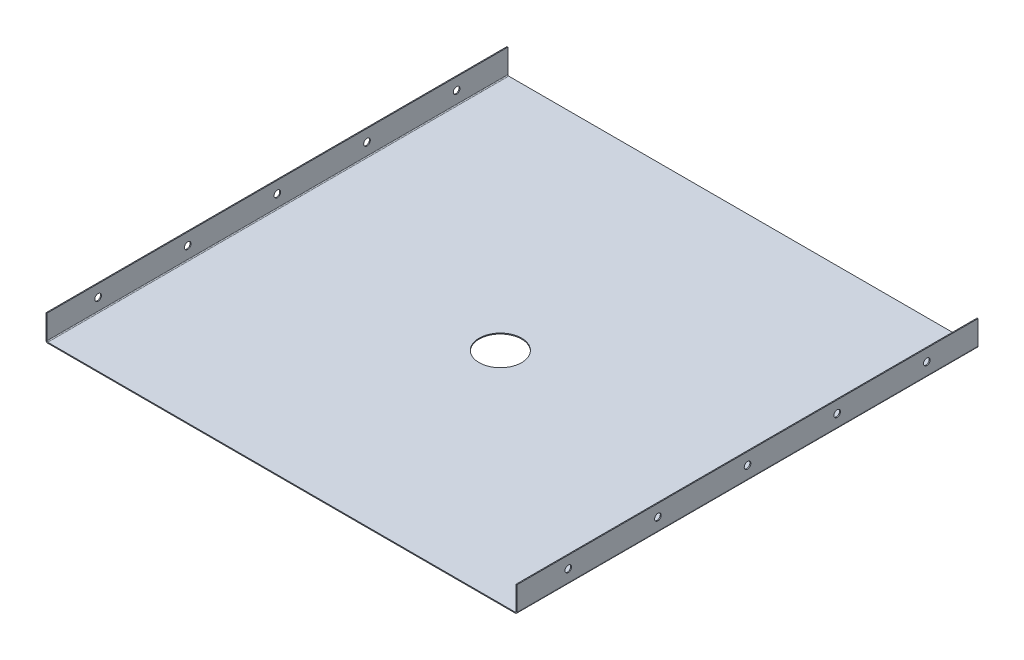
ISO-10303-21;
HEADER;
FILE_DESCRIPTION(('STEP AP214'),'2;1');
FILE_NAME('part.step','',(''),(''),'','','');
FILE_SCHEMA(('AUTOMOTIVE_DESIGN { 1 0 10303 214 1 1 1 1 }'));
ENDSEC;
DATA;
#1=APPLICATION_CONTEXT('core data for automotive mechanical design processes');
#2=APPLICATION_PROTOCOL_DEFINITION('international standard','automotive_design',2000,#1);
#3=PRODUCT_CONTEXT('',#1,'mechanical');
#4=PRODUCT('Part','Part','',(#3));
#5=PRODUCT_RELATED_PRODUCT_CATEGORY('part','',(#4));
#6=PRODUCT_DEFINITION_FORMATION('','',#4);
#7=PRODUCT_DEFINITION_CONTEXT('part definition',#1,'design');
#8=PRODUCT_DEFINITION('design','',#6,#7);
#9=PRODUCT_DEFINITION_SHAPE('','',#8);
#10=(LENGTH_UNIT() NAMED_UNIT(*) SI_UNIT(.MILLI.,.METRE.));
#11=(NAMED_UNIT(*) PLANE_ANGLE_UNIT() SI_UNIT($,.RADIAN.));
#12=(NAMED_UNIT(*) SI_UNIT($,.STERADIAN.) SOLID_ANGLE_UNIT());
#13=UNCERTAINTY_MEASURE_WITH_UNIT(LENGTH_MEASURE(1.E-05),#10,'distance_accuracy_value','');
#14=(GEOMETRIC_REPRESENTATION_CONTEXT(3) GLOBAL_UNCERTAINTY_ASSIGNED_CONTEXT((#13)) GLOBAL_UNIT_ASSIGNED_CONTEXT((#10,
#11,#12)) REPRESENTATION_CONTEXT('',''));
#15=CARTESIAN_POINT('',(0.,0.,0.));
#16=DIRECTION('',(0.,0.,1.));
#17=DIRECTION('',(1.,0.,0.));
#18=AXIS2_PLACEMENT_3D('',#15,#16,#17);
#19=CARTESIAN_POINT('',(0.,0.9144,0.));
#20=DIRECTION('',(0.,-1.,0.));
#21=DIRECTION('',(0.,0.,-1.));
#22=AXIS2_PLACEMENT_3D('',#19,#20,#21);
#23=PLANE('',#22);
#24=CARTESIAN_POINT('',(-0.398780000059662,0.9144,11.125200000079));
#25=DIRECTION('',(0.,1.,0.));
#26=DIRECTION('',(0.,0.,1.));
#27=AXIS2_PLACEMENT_3D('',#24,#25,#26);
#28=CIRCLE('',#27,21.082);
#29=CARTESIAN_POINT('',(-0.398780000059662,0.9144,32.207200000079));
#30=VERTEX_POINT('',#29);
#31=EDGE_CURVE('E668',#30,#30,#28,.T.);
#32=ORIENTED_EDGE('',*,*,#31,.F.);
#33=EDGE_LOOP('',(#32));
#34=FACE_BOUND('',#33,.T.);
#35=DIRECTION('',(0.,0.,-1.));
#36=VECTOR('',#35,1.);
#37=CARTESIAN_POINT('',(231.8004,0.914399999999972,-228.6));
#38=LINE('',#37,#36);
#39=CARTESIAN_POINT('',(231.8004,0.914399999999972,-228.6));
#40=VERTEX_POINT('',#39);
#41=CARTESIAN_POINT('',(231.8004,0.914400000000026,228.6));
#42=VERTEX_POINT('',#41);
#43=EDGE_CURVE('E236',#40,#42,#38,.F.);
#44=ORIENTED_EDGE('',*,*,#43,.F.);
#45=DIRECTION('',(-1.,0.,0.));
#46=VECTOR('',#45,1.);
#47=CARTESIAN_POINT('',(-232.7148,0.9144,-228.6));
#48=LINE('',#47,#46);
#49=CARTESIAN_POINT('',(-231.8004,0.914400000000013,-228.6));
#50=VERTEX_POINT('',#49);
#51=EDGE_CURVE('E48',#40,#50,#48,.T.);
#52=ORIENTED_EDGE('',*,*,#51,.T.);
#53=DIRECTION('',(0.,0.,1.));
#54=VECTOR('',#53,1.);
#55=CARTESIAN_POINT('',(-231.8004,0.914400000000013,228.6));
#56=LINE('',#55,#54);
#57=CARTESIAN_POINT('',(-231.8004,0.914400000000013,228.6));
#58=VERTEX_POINT('',#57);
#59=EDGE_CURVE('E108',#58,#50,#56,.F.);
#60=ORIENTED_EDGE('',*,*,#59,.F.);
#61=DIRECTION('',(1.,0.,0.));
#62=VECTOR('',#61,1.);
#63=CARTESIAN_POINT('',(-232.7148,0.9144,228.6));
#64=LINE('',#63,#62);
#65=EDGE_CURVE('E11',#58,#42,#64,.T.);
#66=ORIENTED_EDGE('',*,*,#65,.T.);
#67=EDGE_LOOP('',(#44,#52,#60,#66));
#68=FACE_BOUND('',#67,.T.);
#69=ADVANCED_FACE('F39',(#34,#68),#23,.F.);
#70=CARTESIAN_POINT('',(0.,0.,0.));
#71=DIRECTION('',(0.,-1.,0.));
#72=DIRECTION('',(0.,0.,-1.));
#73=AXIS2_PLACEMENT_3D('',#70,#71,#72);
#74=PLANE('',#73);
#75=CARTESIAN_POINT('',(-0.398780000059662,0.,11.125200000079));
#76=DIRECTION('',(0.,1.,0.));
#77=DIRECTION('',(0.,0.,1.));
#78=AXIS2_PLACEMENT_3D('',#75,#76,#77);
#79=CIRCLE('',#78,21.082);
#80=CARTESIAN_POINT('',(-0.398780000059662,0.,32.207200000079));
#81=VERTEX_POINT('',#80);
#82=EDGE_CURVE('E666',#81,#81,#79,.T.);
#83=ORIENTED_EDGE('',*,*,#82,.T.);
#84=EDGE_LOOP('',(#83));
#85=FACE_BOUND('',#84,.T.);
#86=DIRECTION('',(1.,0.,0.));
#87=VECTOR('',#86,1.);
#88=CARTESIAN_POINT('',(0.,0.,-228.6));
#89=LINE('',#88,#87);
#90=CARTESIAN_POINT('',(231.8004,0.,-228.6));
#91=VERTEX_POINT('',#90);
#92=CARTESIAN_POINT('',(-231.8004,0.,-228.6));
#93=VERTEX_POINT('',#92);
#94=EDGE_CURVE('E56',#91,#93,#89,.F.);
#95=ORIENTED_EDGE('',*,*,#94,.F.);
#96=DIRECTION('',(0.,0.,-1.));
#97=VECTOR('',#96,1.);
#98=CARTESIAN_POINT('',(231.8004,0.,-228.6));
#99=LINE('',#98,#97);
#100=CARTESIAN_POINT('',(231.8004,0.,228.6));
#101=VERTEX_POINT('',#100);
#102=EDGE_CURVE('E223',#91,#101,#99,.F.);
#103=ORIENTED_EDGE('',*,*,#102,.T.);
#104=DIRECTION('',(1.,0.,0.));
#105=VECTOR('',#104,1.);
#106=CARTESIAN_POINT('',(0.,0.,228.6));
#107=LINE('',#106,#105);
#108=CARTESIAN_POINT('',(-231.8004,0.,228.6));
#109=VERTEX_POINT('',#108);
#110=EDGE_CURVE('E152',#109,#101,#107,.T.);
#111=ORIENTED_EDGE('',*,*,#110,.F.);
#112=DIRECTION('',(0.,0.,1.));
#113=VECTOR('',#112,1.);
#114=CARTESIAN_POINT('',(-231.8004,0.,228.6));
#115=LINE('',#114,#113);
#116=EDGE_CURVE('E64',#109,#93,#115,.F.);
#117=ORIENTED_EDGE('',*,*,#116,.T.);
#118=EDGE_LOOP('',(#95,#103,#111,#117));
#119=FACE_BOUND('',#118,.T.);
#120=ADVANCED_FACE('F280',(#85,#119),#74,.T.);
#121=CARTESIAN_POINT('',(-232.7148,0.9144,-228.6));
#122=DIRECTION('',(0.,0.,1.));
#123=DIRECTION('',(-1.,0.,0.));
#124=AXIS2_PLACEMENT_3D('',#121,#122,#123);
#125=PLANE('',#124);
#126=ORIENTED_EDGE('',*,*,#51,.F.);
#127=DIRECTION('',(0.,-1.,0.));
#128=VECTOR('',#127,1.);
#129=CARTESIAN_POINT('',(231.8004,0.914399999999972,-228.6));
#130=LINE('',#129,#128);
#131=EDGE_CURVE('E230',#40,#91,#130,.T.);
#132=ORIENTED_EDGE('',*,*,#131,.T.);
#133=ORIENTED_EDGE('',*,*,#94,.T.);
#134=DIRECTION('',(0.,-1.,0.));
#135=VECTOR('',#134,1.);
#136=CARTESIAN_POINT('',(-231.8004,0.914400000000013,-228.6));
#137=LINE('',#136,#135);
#138=EDGE_CURVE('E148',#50,#93,#137,.T.);
#139=ORIENTED_EDGE('',*,*,#138,.F.);
#140=EDGE_LOOP('',(#126,#132,#133,#139));
#141=FACE_BOUND('',#140,.T.);
#142=ADVANCED_FACE('F41',(#141),#125,.F.);
#143=CARTESIAN_POINT('',(-232.7148,0.9144,228.6));
#144=DIRECTION('',(0.,0.,-1.));
#145=DIRECTION('',(1.,0.,0.));
#146=AXIS2_PLACEMENT_3D('',#143,#144,#145);
#147=PLANE('',#146);
#148=DIRECTION('',(0.,-1.,0.));
#149=VECTOR('',#148,1.);
#150=CARTESIAN_POINT('',(231.8004,0.914400000000026,228.6));
#151=LINE('',#150,#149);
#152=EDGE_CURVE('E241',#42,#101,#151,.T.);
#153=ORIENTED_EDGE('',*,*,#152,.F.);
#154=ORIENTED_EDGE('',*,*,#65,.F.);
#155=DIRECTION('',(0.,-1.,0.));
#156=VECTOR('',#155,1.);
#157=CARTESIAN_POINT('',(-231.8004,0.914400000000013,228.6));
#158=LINE('',#157,#156);
#159=EDGE_CURVE('E107',#58,#109,#158,.T.);
#160=ORIENTED_EDGE('',*,*,#159,.T.);
#161=ORIENTED_EDGE('',*,*,#110,.T.);
#162=EDGE_LOOP('',(#153,#154,#160,#161));
#163=FACE_BOUND('',#162,.T.);
#164=ADVANCED_FACE('F293',(#163),#147,.F.);
#165=CARTESIAN_POINT('',(-231.8004,1.82880000000002,-228.6));
#166=DIRECTION('',(0.,0.,-1.));
#167=DIRECTION('',(-1.,0.,0.));
#168=AXIS2_PLACEMENT_3D('',#165,#166,#167);
#169=PLANE('',#168);
#170=DIRECTION('',(-1.,0.,0.));
#171=VECTOR('',#170,1.);
#172=CARTESIAN_POINT('',(-232.7148,1.82880000000002,-228.6));
#173=LINE('',#172,#171);
#174=CARTESIAN_POINT('',(-232.7148,1.82880000000002,-228.6));
#175=VERTEX_POINT('',#174);
#176=CARTESIAN_POINT('',(-233.6292,1.82880000000002,-228.6));
#177=VERTEX_POINT('',#176);
#178=EDGE_CURVE('E98',#175,#177,#173,.T.);
#179=ORIENTED_EDGE('',*,*,#178,.F.);
#180=CARTESIAN_POINT('',(-231.8004,1.82880000000002,-228.6));
#181=DIRECTION('',(0.,0.,1.));
#182=DIRECTION('',(1.,0.,0.));
#183=AXIS2_PLACEMENT_3D('',#180,#181,#182);
#184=CIRCLE('',#183,0.91440000000001);
#185=EDGE_CURVE('E92',#50,#175,#184,.F.);
#186=ORIENTED_EDGE('',*,*,#185,.F.);
#187=ORIENTED_EDGE('',*,*,#138,.T.);
#188=CARTESIAN_POINT('',(-231.8004,1.82880000000002,-228.6));
#189=DIRECTION('',(0.,0.,1.));
#190=DIRECTION('',(1.,0.,0.));
#191=AXIS2_PLACEMENT_3D('',#188,#189,#190);
#192=CIRCLE('',#191,1.82880000000001);
#193=EDGE_CURVE('E141',#93,#177,#192,.F.);
#194=ORIENTED_EDGE('',*,*,#193,.T.);
#195=EDGE_LOOP('',(#179,#186,#187,#194));
#196=FACE_BOUND('',#195,.T.);
#197=ADVANCED_FACE('F295',(#196),#169,.T.);
#198=CARTESIAN_POINT('',(-231.8004,1.82880000000002,228.6));
#199=DIRECTION('',(0.,0.,-1.));
#200=DIRECTION('',(-1.,0.,0.));
#201=AXIS2_PLACEMENT_3D('',#198,#199,#200);
#202=PLANE('',#201);
#203=CARTESIAN_POINT('',(-231.8004,1.82880000000002,228.6));
#204=DIRECTION('',(0.,0.,1.));
#205=DIRECTION('',(1.,0.,0.));
#206=AXIS2_PLACEMENT_3D('',#203,#204,#205);
#207=CIRCLE('',#206,0.91440000000001);
#208=CARTESIAN_POINT('',(-232.7148,1.82880000000002,228.6));
#209=VERTEX_POINT('',#208);
#210=EDGE_CURVE('E89',#209,#58,#207,.T.);
#211=ORIENTED_EDGE('',*,*,#210,.F.);
#212=DIRECTION('',(-1.,0.,0.));
#213=VECTOR('',#212,1.);
#214=CARTESIAN_POINT('',(-232.7148,1.82880000000002,228.6));
#215=LINE('',#214,#213);
#216=CARTESIAN_POINT('',(-233.6292,1.82880000000002,228.6));
#217=VERTEX_POINT('',#216);
#218=EDGE_CURVE('E97',#209,#217,#215,.T.);
#219=ORIENTED_EDGE('',*,*,#218,.T.);
#220=CARTESIAN_POINT('',(-231.8004,1.82880000000002,228.6));
#221=DIRECTION('',(0.,0.,1.));
#222=DIRECTION('',(1.,0.,0.));
#223=AXIS2_PLACEMENT_3D('',#220,#221,#222);
#224=CIRCLE('',#223,1.82880000000001);
#225=EDGE_CURVE('E142',#217,#109,#224,.T.);
#226=ORIENTED_EDGE('',*,*,#225,.T.);
#227=ORIENTED_EDGE('',*,*,#159,.F.);
#228=EDGE_LOOP('',(#211,#219,#226,#227));
#229=FACE_BOUND('',#228,.T.);
#230=ADVANCED_FACE('F103',(#229),#202,.F.);
#231=CARTESIAN_POINT('',(-231.8004,1.82880000000002,228.6));
#232=DIRECTION('',(0.,0.,1.));
#233=DIRECTION('',(-1.,0.,0.));
#234=AXIS2_PLACEMENT_3D('',#231,#232,#233);
#235=CYLINDRICAL_SURFACE('',#234,1.82880000000001);
#236=ORIENTED_EDGE('',*,*,#116,.F.);
#237=ORIENTED_EDGE('',*,*,#225,.F.);
#238=DIRECTION('',(0.,0.,-1.));
#239=VECTOR('',#238,1.);
#240=CARTESIAN_POINT('',(-233.6292,1.82880000000002,0.));
#241=LINE('',#240,#239);
#242=EDGE_CURVE('E121',#217,#177,#241,.T.);
#243=ORIENTED_EDGE('',*,*,#242,.T.);
#244=ORIENTED_EDGE('',*,*,#193,.F.);
#245=EDGE_LOOP('',(#236,#237,#243,#244));
#246=FACE_BOUND('',#245,.T.);
#247=ADVANCED_FACE('F327',(#246),#235,.T.);
#248=CARTESIAN_POINT('',(-231.8004,1.82880000000002,228.6));
#249=DIRECTION('',(0.,0.,1.));
#250=DIRECTION('',(-1.,0.,0.));
#251=AXIS2_PLACEMENT_3D('',#248,#249,#250);
#252=CYLINDRICAL_SURFACE('',#251,0.91440000000001);
#253=ORIENTED_EDGE('',*,*,#59,.T.);
#254=ORIENTED_EDGE('',*,*,#185,.T.);
#255=DIRECTION('',(0.,0.,1.));
#256=VECTOR('',#255,1.);
#257=CARTESIAN_POINT('',(-232.7148,1.82880000000002,-228.6));
#258=LINE('',#257,#256);
#259=EDGE_CURVE('E85',#175,#209,#258,.T.);
#260=ORIENTED_EDGE('',*,*,#259,.T.);
#261=ORIENTED_EDGE('',*,*,#210,.T.);
#262=EDGE_LOOP('',(#253,#254,#260,#261));
#263=FACE_BOUND('',#262,.T.);
#264=ADVANCED_FACE('F88',(#263),#252,.F.);
#265=CARTESIAN_POINT('',(-233.6292,25.4,228.6));
#266=DIRECTION('',(0.,0.,-1.));
#267=DIRECTION('',(-1.,0.,0.));
#268=AXIS2_PLACEMENT_3D('',#265,#266,#267);
#269=PLANE('',#268);
#270=ORIENTED_EDGE('',*,*,#218,.F.);
#271=DIRECTION('',(0.,1.,0.));
#272=VECTOR('',#271,1.);
#273=CARTESIAN_POINT('',(-232.7148,25.4,228.6));
#274=LINE('',#273,#272);
#275=CARTESIAN_POINT('',(-232.7148,25.4,228.6));
#276=VERTEX_POINT('',#275);
#277=EDGE_CURVE('E117',#209,#276,#274,.T.);
#278=ORIENTED_EDGE('',*,*,#277,.T.);
#279=DIRECTION('',(1.,0.,0.));
#280=VECTOR('',#279,1.);
#281=CARTESIAN_POINT('',(-233.6292,25.4,228.6));
#282=LINE('',#281,#280);
#283=CARTESIAN_POINT('',(-233.6292,25.4,228.6));
#284=VERTEX_POINT('',#283);
#285=EDGE_CURVE('E109',#284,#276,#282,.T.);
#286=ORIENTED_EDGE('',*,*,#285,.F.);
#287=DIRECTION('',(0.,1.,0.));
#288=VECTOR('',#287,1.);
#289=CARTESIAN_POINT('',(-233.6292,25.4,228.6));
#290=LINE('',#289,#288);
#291=EDGE_CURVE('E120',#217,#284,#290,.T.);
#292=ORIENTED_EDGE('',*,*,#291,.F.);
#293=EDGE_LOOP('',(#270,#278,#286,#292));
#294=FACE_BOUND('',#293,.T.);
#295=ADVANCED_FACE('F114',(#294),#269,.F.);
#296=CARTESIAN_POINT('',(-233.6292,0.914399999999997,-228.6));
#297=DIRECTION('',(0.,0.,1.));
#298=DIRECTION('',(1.,0.,0.));
#299=AXIS2_PLACEMENT_3D('',#296,#297,#298);
#300=PLANE('',#299);
#301=ORIENTED_EDGE('',*,*,#178,.T.);
#302=DIRECTION('',(0.,-1.,0.));
#303=VECTOR('',#302,1.);
#304=CARTESIAN_POINT('',(-233.6292,0.914399999999997,-228.6));
#305=LINE('',#304,#303);
#306=CARTESIAN_POINT('',(-233.6292,25.4,-228.6));
#307=VERTEX_POINT('',#306);
#308=EDGE_CURVE('E132',#307,#177,#305,.T.);
#309=ORIENTED_EDGE('',*,*,#308,.F.);
#310=DIRECTION('',(1.,0.,0.));
#311=VECTOR('',#310,1.);
#312=CARTESIAN_POINT('',(-233.6292,25.4,-228.6));
#313=LINE('',#312,#311);
#314=CARTESIAN_POINT('',(-232.7148,25.4,-228.6));
#315=VERTEX_POINT('',#314);
#316=EDGE_CURVE('E136',#307,#315,#313,.T.);
#317=ORIENTED_EDGE('',*,*,#316,.T.);
#318=DIRECTION('',(0.,-1.,0.));
#319=VECTOR('',#318,1.);
#320=CARTESIAN_POINT('',(-232.7148,0.9144,-228.6));
#321=LINE('',#320,#319);
#322=EDGE_CURVE('E128',#315,#175,#321,.T.);
#323=ORIENTED_EDGE('',*,*,#322,.T.);
#324=EDGE_LOOP('',(#301,#309,#317,#323));
#325=FACE_BOUND('',#324,.T.);
#326=ADVANCED_FACE('F256',(#325),#300,.F.);
#327=CARTESIAN_POINT('',(-233.6292,-7.94572020672313E-13,0.));
#328=DIRECTION('',(1.,0.,0.));
#329=DIRECTION('',(0.,1.,0.));
#330=AXIS2_PLACEMENT_3D('',#327,#328,#329);
#331=PLANE('',#330);
#332=CARTESIAN_POINT('',(-233.6292,13.6143999999996,177.8));
#333=DIRECTION('',(-1.,0.,0.));
#334=DIRECTION('',(0.,0.,1.));
#335=AXIS2_PLACEMENT_3D('',#332,#333,#334);
#336=CIRCLE('',#335,3.26389999999994);
#337=CARTESIAN_POINT('',(-233.6292,13.6143999999996,181.0639));
#338=VERTEX_POINT('',#337);
#339=EDGE_CURVE('E670',#338,#338,#336,.T.);
#340=ORIENTED_EDGE('',*,*,#339,.F.);
#341=EDGE_LOOP('',(#340));
#342=FACE_BOUND('',#341,.T.);
#343=CARTESIAN_POINT('',(-233.6292,13.614399999999,88.8999999999998));
#344=DIRECTION('',(-1.,0.,0.));
#345=DIRECTION('',(0.,0.,1.));
#346=AXIS2_PLACEMENT_3D('',#343,#344,#345);
#347=CIRCLE('',#346,3.26389999999994);
#348=CARTESIAN_POINT('',(-233.6292,13.614399999999,92.1638999999998));
#349=VERTEX_POINT('',#348);
#350=EDGE_CURVE('E684',#349,#349,#347,.T.);
#351=ORIENTED_EDGE('',*,*,#350,.F.);
#352=EDGE_LOOP('',(#351));
#353=FACE_BOUND('',#352,.T.);
#354=CARTESIAN_POINT('',(-233.6292,13.6143999999982,-1.66533453693773E-13));
#355=DIRECTION('',(-1.,0.,0.));
#356=DIRECTION('',(0.,0.,1.));
#357=AXIS2_PLACEMENT_3D('',#354,#355,#356);
#358=CIRCLE('',#357,3.26389999999994);
#359=CARTESIAN_POINT('',(-233.6292,13.6143999999982,3.26389999999977));
#360=VERTEX_POINT('',#359);
#361=EDGE_CURVE('E693',#360,#360,#358,.T.);
#362=ORIENTED_EDGE('',*,*,#361,.F.);
#363=EDGE_LOOP('',(#362));
#364=FACE_BOUND('',#363,.T.);
#365=CARTESIAN_POINT('',(-233.6292,13.6144,-88.9000000000002));
#366=DIRECTION('',(-1.,0.,0.));
#367=DIRECTION('',(0.,0.,1.));
#368=AXIS2_PLACEMENT_3D('',#365,#366,#367);
#369=CIRCLE('',#368,3.26389999999994);
#370=CARTESIAN_POINT('',(-233.6292,13.6144,-85.6361000000002));
#371=VERTEX_POINT('',#370);
#372=EDGE_CURVE('E171',#371,#371,#369,.T.);
#373=ORIENTED_EDGE('',*,*,#372,.F.);
#374=EDGE_LOOP('',(#373));
#375=FACE_BOUND('',#374,.T.);
#376=CARTESIAN_POINT('',(-233.6292,13.6143999999969,-177.8));
#377=DIRECTION('',(-1.,0.,0.));
#378=DIRECTION('',(0.,0.,1.));
#379=AXIS2_PLACEMENT_3D('',#376,#377,#378);
#380=CIRCLE('',#379,3.26389999999994);
#381=CARTESIAN_POINT('',(-233.6292,13.6143999999969,-174.5361));
#382=VERTEX_POINT('',#381);
#383=EDGE_CURVE('E168',#382,#382,#380,.T.);
#384=ORIENTED_EDGE('',*,*,#383,.F.);
#385=EDGE_LOOP('',(#384));
#386=FACE_BOUND('',#385,.T.);
#387=ORIENTED_EDGE('',*,*,#242,.F.);
#388=ORIENTED_EDGE('',*,*,#291,.T.);
#389=DIRECTION('',(0.,0.,-1.));
#390=VECTOR('',#389,1.);
#391=CARTESIAN_POINT('',(-233.6292,25.4,-228.6));
#392=LINE('',#391,#390);
#393=EDGE_CURVE('E247',#284,#307,#392,.T.);
#394=ORIENTED_EDGE('',*,*,#393,.T.);
#395=ORIENTED_EDGE('',*,*,#308,.T.);
#396=EDGE_LOOP('',(#387,#388,#394,#395));
#397=FACE_BOUND('',#396,.T.);
#398=ADVANCED_FACE('F254',(#342,#353,#364,#375,#386,#397),#331,.F.);
#399=CARTESIAN_POINT('',(-232.7148,-7.91379410136075E-13,0.));
#400=DIRECTION('',(1.,0.,0.));
#401=DIRECTION('',(0.,1.,0.));
#402=AXIS2_PLACEMENT_3D('',#399,#400,#401);
#403=PLANE('',#402);
#404=CARTESIAN_POINT('',(-232.7148,13.6143999999996,177.8));
#405=DIRECTION('',(1.,0.,0.));
#406=DIRECTION('',(0.,1.,0.));
#407=AXIS2_PLACEMENT_3D('',#404,#405,#406);
#408=CIRCLE('',#407,3.26389999999991);
#409=CARTESIAN_POINT('',(-232.7148,16.8782999999995,177.8));
#410=VERTEX_POINT('',#409);
#411=EDGE_CURVE('E681',#410,#410,#408,.T.);
#412=ORIENTED_EDGE('',*,*,#411,.F.);
#413=EDGE_LOOP('',(#412));
#414=FACE_BOUND('',#413,.T.);
#415=CARTESIAN_POINT('',(-232.7148,13.614399999999,88.8999999999998));
#416=DIRECTION('',(1.,0.,0.));
#417=DIRECTION('',(0.,1.,0.));
#418=AXIS2_PLACEMENT_3D('',#415,#416,#417);
#419=CIRCLE('',#418,3.26389999999991);
#420=CARTESIAN_POINT('',(-232.7148,16.8782999999989,88.8999999999998));
#421=VERTEX_POINT('',#420);
#422=EDGE_CURVE('E690',#421,#421,#419,.T.);
#423=ORIENTED_EDGE('',*,*,#422,.F.);
#424=EDGE_LOOP('',(#423));
#425=FACE_BOUND('',#424,.T.);
#426=CARTESIAN_POINT('',(-232.7148,13.6143999999982,-1.66533453693773E-13));
#427=DIRECTION('',(1.,0.,0.));
#428=DIRECTION('',(0.,1.,0.));
#429=AXIS2_PLACEMENT_3D('',#426,#427,#428);
#430=CIRCLE('',#429,3.26389999999991);
#431=CARTESIAN_POINT('',(-232.7148,16.8782999999981,-1.66533453693773E-13));
#432=VERTEX_POINT('',#431);
#433=EDGE_CURVE('E176',#432,#432,#430,.T.);
#434=ORIENTED_EDGE('',*,*,#433,.F.);
#435=EDGE_LOOP('',(#434));
#436=FACE_BOUND('',#435,.T.);
#437=CARTESIAN_POINT('',(-232.7148,13.6144,-88.9000000000002));
#438=DIRECTION('',(1.,0.,0.));
#439=DIRECTION('',(0.,1.,0.));
#440=AXIS2_PLACEMENT_3D('',#437,#438,#439);
#441=CIRCLE('',#440,3.26389999999991);
#442=CARTESIAN_POINT('',(-232.7148,16.8782999999999,-88.9000000000002));
#443=VERTEX_POINT('',#442);
#444=EDGE_CURVE('E163',#443,#443,#441,.T.);
#445=ORIENTED_EDGE('',*,*,#444,.F.);
#446=EDGE_LOOP('',(#445));
#447=FACE_BOUND('',#446,.T.);
#448=CARTESIAN_POINT('',(-232.7148,13.6143999999969,-177.8));
#449=DIRECTION('',(1.,0.,0.));
#450=DIRECTION('',(0.,1.,0.));
#451=AXIS2_PLACEMENT_3D('',#448,#449,#450);
#452=CIRCLE('',#451,3.26389999999991);
#453=CARTESIAN_POINT('',(-232.7148,16.8782999999968,-177.8));
#454=VERTEX_POINT('',#453);
#455=EDGE_CURVE('E159',#454,#454,#452,.T.);
#456=ORIENTED_EDGE('',*,*,#455,.F.);
#457=EDGE_LOOP('',(#456));
#458=FACE_BOUND('',#457,.T.);
#459=ORIENTED_EDGE('',*,*,#277,.F.);
#460=ORIENTED_EDGE('',*,*,#259,.F.);
#461=ORIENTED_EDGE('',*,*,#322,.F.);
#462=DIRECTION('',(0.,0.,-1.));
#463=VECTOR('',#462,1.);
#464=CARTESIAN_POINT('',(-232.7148,25.4,-228.6));
#465=LINE('',#464,#463);
#466=EDGE_CURVE('E126',#276,#315,#465,.T.);
#467=ORIENTED_EDGE('',*,*,#466,.F.);
#468=EDGE_LOOP('',(#459,#460,#461,#467));
#469=FACE_BOUND('',#468,.T.);
#470=ADVANCED_FACE('F124',(#414,#425,#436,#447,#458,#469),#403,.T.);
#471=CARTESIAN_POINT('',(-233.6292,25.4,-228.6));
#472=DIRECTION('',(0.,-1.,0.));
#473=DIRECTION('',(1.,0.,0.));
#474=AXIS2_PLACEMENT_3D('',#471,#472,#473);
#475=PLANE('',#474);
#476=ORIENTED_EDGE('',*,*,#466,.T.);
#477=ORIENTED_EDGE('',*,*,#316,.F.);
#478=ORIENTED_EDGE('',*,*,#393,.F.);
#479=ORIENTED_EDGE('',*,*,#285,.T.);
#480=EDGE_LOOP('',(#476,#477,#478,#479));
#481=FACE_BOUND('',#480,.T.);
#482=ADVANCED_FACE('F264',(#481),#475,.F.);
#483=CARTESIAN_POINT('',(231.8004,1.82880000000004,228.6));
#484=DIRECTION('',(0.,0.,1.));
#485=DIRECTION('',(0.,-1.,0.));
#486=AXIS2_PLACEMENT_3D('',#483,#484,#485);
#487=PLANE('',#486);
#488=DIRECTION('',(1.,0.,0.));
#489=VECTOR('',#488,1.);
#490=CARTESIAN_POINT('',(232.7148,1.82880000000002,228.6));
#491=LINE('',#490,#489);
#492=CARTESIAN_POINT('',(232.7148,1.82880000000003,228.6));
#493=VERTEX_POINT('',#492);
#494=CARTESIAN_POINT('',(233.6292,1.82880000000003,228.6));
#495=VERTEX_POINT('',#494);
#496=EDGE_CURVE('E186',#493,#495,#491,.T.);
#497=ORIENTED_EDGE('',*,*,#496,.F.);
#498=CARTESIAN_POINT('',(231.8004,1.82880000000004,228.6));
#499=DIRECTION('',(0.,0.,-1.));
#500=DIRECTION('',(0.,1.,0.));
#501=AXIS2_PLACEMENT_3D('',#498,#499,#500);
#502=CIRCLE('',#501,0.91440000000001);
#503=EDGE_CURVE('E233',#42,#493,#502,.F.);
#504=ORIENTED_EDGE('',*,*,#503,.F.);
#505=ORIENTED_EDGE('',*,*,#152,.T.);
#506=CARTESIAN_POINT('',(231.8004,1.82880000000004,228.6));
#507=DIRECTION('',(0.,0.,-1.));
#508=DIRECTION('',(0.,1.,0.));
#509=AXIS2_PLACEMENT_3D('',#506,#507,#508);
#510=CIRCLE('',#509,1.82880000000001);
#511=EDGE_CURVE('E226',#101,#495,#510,.F.);
#512=ORIENTED_EDGE('',*,*,#511,.T.);
#513=EDGE_LOOP('',(#497,#504,#505,#512));
#514=FACE_BOUND('',#513,.T.);
#515=ADVANCED_FACE('F266',(#514),#487,.T.);
#516=CARTESIAN_POINT('',(231.8004,1.82879999999998,-228.6));
#517=DIRECTION('',(0.,0.,1.));
#518=DIRECTION('',(0.,-1.,0.));
#519=AXIS2_PLACEMENT_3D('',#516,#517,#518);
#520=PLANE('',#519);
#521=CARTESIAN_POINT('',(231.8004,1.82879999999998,-228.6));
#522=DIRECTION('',(0.,0.,-1.));
#523=DIRECTION('',(0.,1.,0.));
#524=AXIS2_PLACEMENT_3D('',#521,#522,#523);
#525=CIRCLE('',#524,0.91440000000001);
#526=CARTESIAN_POINT('',(232.7148,1.82879999999998,-228.6));
#527=VERTEX_POINT('',#526);
#528=EDGE_CURVE('E222',#527,#40,#525,.T.);
#529=ORIENTED_EDGE('',*,*,#528,.F.);
#530=DIRECTION('',(1.,0.,0.));
#531=VECTOR('',#530,1.);
#532=CARTESIAN_POINT('',(232.7148,1.82879999999999,-228.6));
#533=LINE('',#532,#531);
#534=CARTESIAN_POINT('',(233.6292,1.82879999999999,-228.6));
#535=VERTEX_POINT('',#534);
#536=EDGE_CURVE('E190',#527,#535,#533,.T.);
#537=ORIENTED_EDGE('',*,*,#536,.T.);
#538=CARTESIAN_POINT('',(231.8004,1.82879999999998,-228.6));
#539=DIRECTION('',(0.,0.,-1.));
#540=DIRECTION('',(0.,1.,0.));
#541=AXIS2_PLACEMENT_3D('',#538,#539,#540);
#542=CIRCLE('',#541,1.82880000000001);
#543=EDGE_CURVE('E227',#535,#91,#542,.T.);
#544=ORIENTED_EDGE('',*,*,#543,.T.);
#545=ORIENTED_EDGE('',*,*,#131,.F.);
#546=EDGE_LOOP('',(#529,#537,#544,#545));
#547=FACE_BOUND('',#546,.T.);
#548=ADVANCED_FACE('F272',(#547),#520,.F.);
#549=CARTESIAN_POINT('',(231.8004,1.82879999999998,-228.6));
#550=DIRECTION('',(0.,0.,-1.));
#551=DIRECTION('',(1.,0.,0.));
#552=AXIS2_PLACEMENT_3D('',#549,#550,#551);
#553=CYLINDRICAL_SURFACE('',#552,1.82880000000001);
#554=ORIENTED_EDGE('',*,*,#102,.F.);
#555=ORIENTED_EDGE('',*,*,#543,.F.);
#556=DIRECTION('',(0.,0.,1.));
#557=VECTOR('',#556,1.);
#558=CARTESIAN_POINT('',(233.6292,1.8288,0.));
#559=LINE('',#558,#557);
#560=EDGE_CURVE('E193',#535,#495,#559,.T.);
#561=ORIENTED_EDGE('',*,*,#560,.T.);
#562=ORIENTED_EDGE('',*,*,#511,.F.);
#563=EDGE_LOOP('',(#554,#555,#561,#562));
#564=FACE_BOUND('',#563,.T.);
#565=ADVANCED_FACE('F332',(#564),#553,.T.);
#566=CARTESIAN_POINT('',(231.8004,1.82879999999998,-228.6));
#567=DIRECTION('',(0.,0.,-1.));
#568=DIRECTION('',(1.,0.,0.));
#569=AXIS2_PLACEMENT_3D('',#566,#567,#568);
#570=CYLINDRICAL_SURFACE('',#569,0.91440000000001);
#571=ORIENTED_EDGE('',*,*,#43,.T.);
#572=ORIENTED_EDGE('',*,*,#503,.T.);
#573=DIRECTION('',(0.,0.,-1.));
#574=VECTOR('',#573,1.);
#575=CARTESIAN_POINT('',(232.7148,1.82880000000002,228.6));
#576=LINE('',#575,#574);
#577=EDGE_CURVE('E187',#493,#527,#576,.T.);
#578=ORIENTED_EDGE('',*,*,#577,.T.);
#579=ORIENTED_EDGE('',*,*,#528,.T.);
#580=EDGE_LOOP('',(#571,#572,#578,#579));
#581=FACE_BOUND('',#580,.T.);
#582=ADVANCED_FACE('F365',(#581),#570,.F.);
#583=CARTESIAN_POINT('',(233.6292,25.4,-228.6));
#584=DIRECTION('',(0.,0.,1.));
#585=DIRECTION('',(1.,0.,0.));
#586=AXIS2_PLACEMENT_3D('',#583,#584,#585);
#587=PLANE('',#586);
#588=ORIENTED_EDGE('',*,*,#536,.F.);
#589=DIRECTION('',(0.,1.,0.));
#590=VECTOR('',#589,1.);
#591=CARTESIAN_POINT('',(232.7148,25.4,-228.6));
#592=LINE('',#591,#590);
#593=CARTESIAN_POINT('',(232.7148,25.4,-228.6));
#594=VERTEX_POINT('',#593);
#595=EDGE_CURVE('E198',#527,#594,#592,.T.);
#596=ORIENTED_EDGE('',*,*,#595,.T.);
#597=DIRECTION('',(-1.,0.,0.));
#598=VECTOR('',#597,1.);
#599=CARTESIAN_POINT('',(233.6292,25.4,-228.6));
#600=LINE('',#599,#598);
#601=CARTESIAN_POINT('',(233.6292,25.4,-228.6));
#602=VERTEX_POINT('',#601);
#603=EDGE_CURVE('E219',#602,#594,#600,.T.);
#604=ORIENTED_EDGE('',*,*,#603,.F.);
#605=DIRECTION('',(0.,1.,0.));
#606=VECTOR('',#605,1.);
#607=CARTESIAN_POINT('',(233.6292,25.4,-228.6));
#608=LINE('',#607,#606);
#609=EDGE_CURVE('E199',#535,#602,#608,.T.);
#610=ORIENTED_EDGE('',*,*,#609,.F.);
#611=EDGE_LOOP('',(#588,#596,#604,#610));
#612=FACE_BOUND('',#611,.T.);
#613=ADVANCED_FACE('F346',(#612),#587,.F.);
#614=CARTESIAN_POINT('',(233.6292,0.914399999999997,228.6));
#615=DIRECTION('',(0.,0.,-1.));
#616=DIRECTION('',(-1.,0.,0.));
#617=AXIS2_PLACEMENT_3D('',#614,#615,#616);
#618=PLANE('',#617);
#619=ORIENTED_EDGE('',*,*,#496,.T.);
#620=DIRECTION('',(0.,-1.,0.));
#621=VECTOR('',#620,1.);
#622=CARTESIAN_POINT('',(233.6292,0.914399999999997,228.6));
#623=LINE('',#622,#621);
#624=CARTESIAN_POINT('',(233.6292,25.4,228.6));
#625=VERTEX_POINT('',#624);
#626=EDGE_CURVE('E206',#625,#495,#623,.T.);
#627=ORIENTED_EDGE('',*,*,#626,.F.);
#628=DIRECTION('',(-1.,0.,0.));
#629=VECTOR('',#628,1.);
#630=CARTESIAN_POINT('',(233.6292,25.4,228.6));
#631=LINE('',#630,#629);
#632=CARTESIAN_POINT('',(232.7148,25.4,228.6));
#633=VERTEX_POINT('',#632);
#634=EDGE_CURVE('E209',#625,#633,#631,.T.);
#635=ORIENTED_EDGE('',*,*,#634,.T.);
#636=DIRECTION('',(0.,-1.,0.));
#637=VECTOR('',#636,1.);
#638=CARTESIAN_POINT('',(232.7148,0.9144,228.6));
#639=LINE('',#638,#637);
#640=EDGE_CURVE('E203',#633,#493,#639,.T.);
#641=ORIENTED_EDGE('',*,*,#640,.T.);
#642=EDGE_LOOP('',(#619,#627,#635,#641));
#643=FACE_BOUND('',#642,.T.);
#644=ADVANCED_FACE('F361',(#643),#618,.F.);
#645=CARTESIAN_POINT('',(233.6292,-7.94572020672313E-13,0.));
#646=DIRECTION('',(-1.,0.,0.));
#647=DIRECTION('',(0.,-1.,0.));
#648=AXIS2_PLACEMENT_3D('',#645,#646,#647);
#649=PLANE('',#648);
#650=CARTESIAN_POINT('',(233.6292,13.6143999999996,177.8));
#651=DIRECTION('',(-1.,0.,0.));
#652=DIRECTION('',(0.,0.,1.));
#653=AXIS2_PLACEMENT_3D('',#650,#651,#652);
#654=CIRCLE('',#653,3.26389999999989);
#655=CARTESIAN_POINT('',(233.6292,13.6143999999996,181.0639));
#656=VERTEX_POINT('',#655);
#657=EDGE_CURVE('E675',#656,#656,#654,.T.);
#658=ORIENTED_EDGE('',*,*,#657,.T.);
#659=EDGE_LOOP('',(#658));
#660=FACE_BOUND('',#659,.T.);
#661=CARTESIAN_POINT('',(233.6292,13.614399999999,88.8999999999998));
#662=DIRECTION('',(-1.,0.,0.));
#663=DIRECTION('',(0.,0.,1.));
#664=AXIS2_PLACEMENT_3D('',#661,#662,#663);
#665=CIRCLE('',#664,3.26389999999989);
#666=CARTESIAN_POINT('',(233.6292,13.614399999999,92.1638999999997));
#667=VERTEX_POINT('',#666);
#668=EDGE_CURVE('E687',#667,#667,#665,.T.);
#669=ORIENTED_EDGE('',*,*,#668,.T.);
#670=EDGE_LOOP('',(#669));
#671=FACE_BOUND('',#670,.T.);
#672=CARTESIAN_POINT('',(233.6292,13.6143999999982,-1.66533453693773E-13));
#673=DIRECTION('',(-1.,0.,0.));
#674=DIRECTION('',(0.,0.,1.));
#675=AXIS2_PLACEMENT_3D('',#672,#673,#674);
#676=CIRCLE('',#675,3.26389999999989);
#677=CARTESIAN_POINT('',(233.6292,13.6143999999982,3.26389999999972));
#678=VERTEX_POINT('',#677);
#679=EDGE_CURVE('E696',#678,#678,#676,.T.);
#680=ORIENTED_EDGE('',*,*,#679,.T.);
#681=EDGE_LOOP('',(#680));
#682=FACE_BOUND('',#681,.T.);
#683=CARTESIAN_POINT('',(233.6292,13.6144,-88.9000000000002));
#684=DIRECTION('',(-1.,0.,0.));
#685=DIRECTION('',(0.,0.,1.));
#686=AXIS2_PLACEMENT_3D('',#683,#684,#685);
#687=CIRCLE('',#686,3.26389999999989);
#688=CARTESIAN_POINT('',(233.6292,13.6144,-85.6361000000003));
#689=VERTEX_POINT('',#688);
#690=EDGE_CURVE('E164',#689,#689,#687,.T.);
#691=ORIENTED_EDGE('',*,*,#690,.T.);
#692=EDGE_LOOP('',(#691));
#693=FACE_BOUND('',#692,.T.);
#694=CARTESIAN_POINT('',(233.6292,13.6143999999969,-177.8));
#695=DIRECTION('',(-1.,0.,0.));
#696=DIRECTION('',(0.,0.,1.));
#697=AXIS2_PLACEMENT_3D('',#694,#695,#696);
#698=CIRCLE('',#697,3.26389999999989);
#699=CARTESIAN_POINT('',(233.6292,13.6143999999969,-174.5361));
#700=VERTEX_POINT('',#699);
#701=EDGE_CURVE('E160',#700,#700,#698,.T.);
#702=ORIENTED_EDGE('',*,*,#701,.T.);
#703=EDGE_LOOP('',(#702));
#704=FACE_BOUND('',#703,.T.);
#705=ORIENTED_EDGE('',*,*,#560,.F.);
#706=ORIENTED_EDGE('',*,*,#609,.T.);
#707=DIRECTION('',(0.,0.,1.));
#708=VECTOR('',#707,1.);
#709=CARTESIAN_POINT('',(233.6292,25.4,228.6));
#710=LINE('',#709,#708);
#711=EDGE_CURVE('E202',#602,#625,#710,.T.);
#712=ORIENTED_EDGE('',*,*,#711,.T.);
#713=ORIENTED_EDGE('',*,*,#626,.T.);
#714=EDGE_LOOP('',(#705,#706,#712,#713));
#715=FACE_BOUND('',#714,.T.);
#716=ADVANCED_FACE('F342',(#660,#671,#682,#693,#704,#715),#649,.F.);
#717=CARTESIAN_POINT('',(232.7148,-7.91379410136075E-13,0.));
#718=DIRECTION('',(-1.,0.,0.));
#719=DIRECTION('',(0.,-1.,0.));
#720=AXIS2_PLACEMENT_3D('',#717,#718,#719);
#721=PLANE('',#720);
#722=CARTESIAN_POINT('',(232.7148,13.6143999999996,177.8));
#723=DIRECTION('',(-1.,0.,0.));
#724=DIRECTION('',(0.,-1.,0.));
#725=AXIS2_PLACEMENT_3D('',#722,#723,#724);
#726=CIRCLE('',#725,3.26389999999991);
#727=CARTESIAN_POINT('',(232.7148,10.3504999999997,177.8));
#728=VERTEX_POINT('',#727);
#729=EDGE_CURVE('E678',#728,#728,#726,.T.);
#730=ORIENTED_EDGE('',*,*,#729,.F.);
#731=EDGE_LOOP('',(#730));
#732=FACE_BOUND('',#731,.T.);
#733=CARTESIAN_POINT('',(232.7148,13.614399999999,88.8999999999998));
#734=DIRECTION('',(-1.,0.,0.));
#735=DIRECTION('',(0.,-1.,0.));
#736=AXIS2_PLACEMENT_3D('',#733,#734,#735);
#737=CIRCLE('',#736,3.26389999999991);
#738=CARTESIAN_POINT('',(232.7148,10.3504999999991,88.8999999999998));
#739=VERTEX_POINT('',#738);
#740=EDGE_CURVE('E43',#739,#739,#737,.T.);
#741=ORIENTED_EDGE('',*,*,#740,.F.);
#742=EDGE_LOOP('',(#741));
#743=FACE_BOUND('',#742,.T.);
#744=CARTESIAN_POINT('',(232.7148,13.6143999999982,-1.66533453693773E-13));
#745=DIRECTION('',(-1.,0.,0.));
#746=DIRECTION('',(0.,-1.,0.));
#747=AXIS2_PLACEMENT_3D('',#744,#745,#746);
#748=CIRCLE('',#747,3.26389999999991);
#749=CARTESIAN_POINT('',(232.7148,10.3504999999983,-1.66533453693773E-13));
#750=VERTEX_POINT('',#749);
#751=EDGE_CURVE('E699',#750,#750,#748,.T.);
#752=ORIENTED_EDGE('',*,*,#751,.F.);
#753=EDGE_LOOP('',(#752));
#754=FACE_BOUND('',#753,.T.);
#755=CARTESIAN_POINT('',(232.7148,13.6144,-88.9000000000002));
#756=DIRECTION('',(-1.,0.,0.));
#757=DIRECTION('',(0.,-1.,0.));
#758=AXIS2_PLACEMENT_3D('',#755,#756,#757);
#759=CIRCLE('',#758,3.26389999999991);
#760=CARTESIAN_POINT('',(232.7148,10.3505000000001,-88.9000000000002));
#761=VERTEX_POINT('',#760);
#762=EDGE_CURVE('E161',#761,#761,#759,.T.);
#763=ORIENTED_EDGE('',*,*,#762,.F.);
#764=EDGE_LOOP('',(#763));
#765=FACE_BOUND('',#764,.T.);
#766=CARTESIAN_POINT('',(232.7148,13.6143999999969,-177.8));
#767=DIRECTION('',(-1.,0.,0.));
#768=DIRECTION('',(0.,-1.,0.));
#769=AXIS2_PLACEMENT_3D('',#766,#767,#768);
#770=CIRCLE('',#769,3.26389999999991);
#771=CARTESIAN_POINT('',(232.7148,10.350499999997,-177.8));
#772=VERTEX_POINT('',#771);
#773=EDGE_CURVE('E157',#772,#772,#770,.T.);
#774=ORIENTED_EDGE('',*,*,#773,.F.);
#775=EDGE_LOOP('',(#774));
#776=FACE_BOUND('',#775,.T.);
#777=ORIENTED_EDGE('',*,*,#595,.F.);
#778=ORIENTED_EDGE('',*,*,#577,.F.);
#779=ORIENTED_EDGE('',*,*,#640,.F.);
#780=DIRECTION('',(0.,0.,1.));
#781=VECTOR('',#780,1.);
#782=CARTESIAN_POINT('',(232.7148,25.4,228.6));
#783=LINE('',#782,#781);
#784=EDGE_CURVE('E212',#594,#633,#783,.T.);
#785=ORIENTED_EDGE('',*,*,#784,.F.);
#786=EDGE_LOOP('',(#777,#778,#779,#785));
#787=FACE_BOUND('',#786,.T.);
#788=ADVANCED_FACE('F363',(#732,#743,#754,#765,#776,#787),#721,.T.);
#789=CARTESIAN_POINT('',(233.6292,25.4,228.6));
#790=DIRECTION('',(0.,-1.,0.));
#791=DIRECTION('',(1.,0.,0.));
#792=AXIS2_PLACEMENT_3D('',#789,#790,#791);
#793=PLANE('',#792);
#794=ORIENTED_EDGE('',*,*,#784,.T.);
#795=ORIENTED_EDGE('',*,*,#634,.F.);
#796=ORIENTED_EDGE('',*,*,#711,.F.);
#797=ORIENTED_EDGE('',*,*,#603,.T.);
#798=EDGE_LOOP('',(#794,#795,#796,#797));
#799=FACE_BOUND('',#798,.T.);
#800=ADVANCED_FACE('F353',(#799),#793,.F.);
#801=CARTESIAN_POINT('',(-233.6292,13.6143999999969,-177.8));
#802=DIRECTION('',(-1.,0.,0.));
#803=DIRECTION('',(0.,0.,1.));
#804=AXIS2_PLACEMENT_3D('',#801,#802,#803);
#805=CYLINDRICAL_SURFACE('',#804,3.26389999999991);
#806=ORIENTED_EDGE('',*,*,#773,.T.);
#807=EDGE_LOOP('',(#806));
#808=FACE_BOUND('',#807,.T.);
#809=ORIENTED_EDGE('',*,*,#701,.F.);
#810=EDGE_LOOP('',(#809));
#811=FACE_BOUND('',#810,.T.);
#812=ADVANCED_FACE('F551',(#808,#811),#805,.F.);
#813=ORIENTED_EDGE('',*,*,#455,.T.);
#814=EDGE_LOOP('',(#813));
#815=FACE_BOUND('',#814,.T.);
#816=ORIENTED_EDGE('',*,*,#383,.T.);
#817=EDGE_LOOP('',(#816));
#818=FACE_BOUND('',#817,.T.);
#819=ADVANCED_FACE('F560',(#815,#818),#805,.F.);
#820=CARTESIAN_POINT('',(-233.6292,13.6144,-88.9000000000002));
#821=DIRECTION('',(-1.,0.,0.));
#822=DIRECTION('',(0.,0.,1.));
#823=AXIS2_PLACEMENT_3D('',#820,#821,#822);
#824=CYLINDRICAL_SURFACE('',#823,3.26389999999991);
#825=ORIENTED_EDGE('',*,*,#762,.T.);
#826=EDGE_LOOP('',(#825));
#827=FACE_BOUND('',#826,.T.);
#828=ORIENTED_EDGE('',*,*,#690,.F.);
#829=EDGE_LOOP('',(#828));
#830=FACE_BOUND('',#829,.T.);
#831=ADVANCED_FACE('F569',(#827,#830),#824,.F.);
#832=ORIENTED_EDGE('',*,*,#444,.T.);
#833=EDGE_LOOP('',(#832));
#834=FACE_BOUND('',#833,.T.);
#835=ORIENTED_EDGE('',*,*,#372,.T.);
#836=EDGE_LOOP('',(#835));
#837=FACE_BOUND('',#836,.T.);
#838=ADVANCED_FACE('F577',(#834,#837),#824,.F.);
#839=CARTESIAN_POINT('',(-233.6292,13.6143999999982,-1.66533453693773E-13));
#840=DIRECTION('',(-1.,0.,0.));
#841=DIRECTION('',(0.,0.,1.));
#842=AXIS2_PLACEMENT_3D('',#839,#840,#841);
#843=CYLINDRICAL_SURFACE('',#842,3.26389999999991);
#844=ORIENTED_EDGE('',*,*,#751,.T.);
#845=EDGE_LOOP('',(#844));
#846=FACE_BOUND('',#845,.T.);
#847=ORIENTED_EDGE('',*,*,#679,.F.);
#848=EDGE_LOOP('',(#847));
#849=FACE_BOUND('',#848,.T.);
#850=ADVANCED_FACE('F585',(#846,#849),#843,.F.);
#851=ORIENTED_EDGE('',*,*,#433,.T.);
#852=EDGE_LOOP('',(#851));
#853=FACE_BOUND('',#852,.T.);
#854=ORIENTED_EDGE('',*,*,#361,.T.);
#855=EDGE_LOOP('',(#854));
#856=FACE_BOUND('',#855,.T.);
#857=ADVANCED_FACE('F593',(#853,#856),#843,.F.);
#858=CARTESIAN_POINT('',(-233.6292,13.614399999999,88.8999999999998));
#859=DIRECTION('',(-1.,0.,0.));
#860=DIRECTION('',(0.,0.,1.));
#861=AXIS2_PLACEMENT_3D('',#858,#859,#860);
#862=CYLINDRICAL_SURFACE('',#861,3.26389999999991);
#863=ORIENTED_EDGE('',*,*,#740,.T.);
#864=EDGE_LOOP('',(#863));
#865=FACE_BOUND('',#864,.T.);
#866=ORIENTED_EDGE('',*,*,#668,.F.);
#867=EDGE_LOOP('',(#866));
#868=FACE_BOUND('',#867,.T.);
#869=ADVANCED_FACE('F602',(#865,#868),#862,.F.);
#870=ORIENTED_EDGE('',*,*,#422,.T.);
#871=EDGE_LOOP('',(#870));
#872=FACE_BOUND('',#871,.T.);
#873=ORIENTED_EDGE('',*,*,#350,.T.);
#874=EDGE_LOOP('',(#873));
#875=FACE_BOUND('',#874,.T.);
#876=ADVANCED_FACE('F610',(#872,#875),#862,.F.);
#877=CARTESIAN_POINT('',(-233.6292,13.6143999999996,177.8));
#878=DIRECTION('',(-1.,0.,0.));
#879=DIRECTION('',(0.,0.,1.));
#880=AXIS2_PLACEMENT_3D('',#877,#878,#879);
#881=CYLINDRICAL_SURFACE('',#880,3.26389999999991);
#882=ORIENTED_EDGE('',*,*,#729,.T.);
#883=EDGE_LOOP('',(#882));
#884=FACE_BOUND('',#883,.T.);
#885=ORIENTED_EDGE('',*,*,#657,.F.);
#886=EDGE_LOOP('',(#885));
#887=FACE_BOUND('',#886,.T.);
#888=ADVANCED_FACE('F619',(#884,#887),#881,.F.);
#889=ORIENTED_EDGE('',*,*,#411,.T.);
#890=EDGE_LOOP('',(#889));
#891=FACE_BOUND('',#890,.T.);
#892=ORIENTED_EDGE('',*,*,#339,.T.);
#893=EDGE_LOOP('',(#892));
#894=FACE_BOUND('',#893,.T.);
#895=ADVANCED_FACE('F627',(#891,#894),#881,.F.);
#896=CARTESIAN_POINT('',(-0.398780000059662,0.,11.125200000079));
#897=DIRECTION('',(0.,1.,0.));
#898=DIRECTION('',(0.,0.,1.));
#899=AXIS2_PLACEMENT_3D('',#896,#897,#898);
#900=CYLINDRICAL_SURFACE('',#899,21.082);
#901=ORIENTED_EDGE('',*,*,#82,.F.);
#902=EDGE_LOOP('',(#901));
#903=FACE_BOUND('',#902,.T.);
#904=ORIENTED_EDGE('',*,*,#31,.T.);
#905=EDGE_LOOP('',(#904));
#906=FACE_BOUND('',#905,.T.);
#907=ADVANCED_FACE('F635',(#903,#906),#900,.F.);
#908=CLOSED_SHELL('',(#69,#120,#142,#164,#197,#230,#247,#264,#295,#326,#398,#470,#482,#515,#548,
#565,#582,#613,#644,#716,#788,#800,#812,#819,#831,#838,#850,#857,#869,#876,#888,#895,#907));
#909=MANIFOLD_SOLID_BREP('B2',#908);
#910=ADVANCED_BREP_SHAPE_REPRESENTATION('',(#18,#909),#14);
#911=SHAPE_DEFINITION_REPRESENTATION(#9,#910);
ENDSEC;
END-ISO-10303-21;
